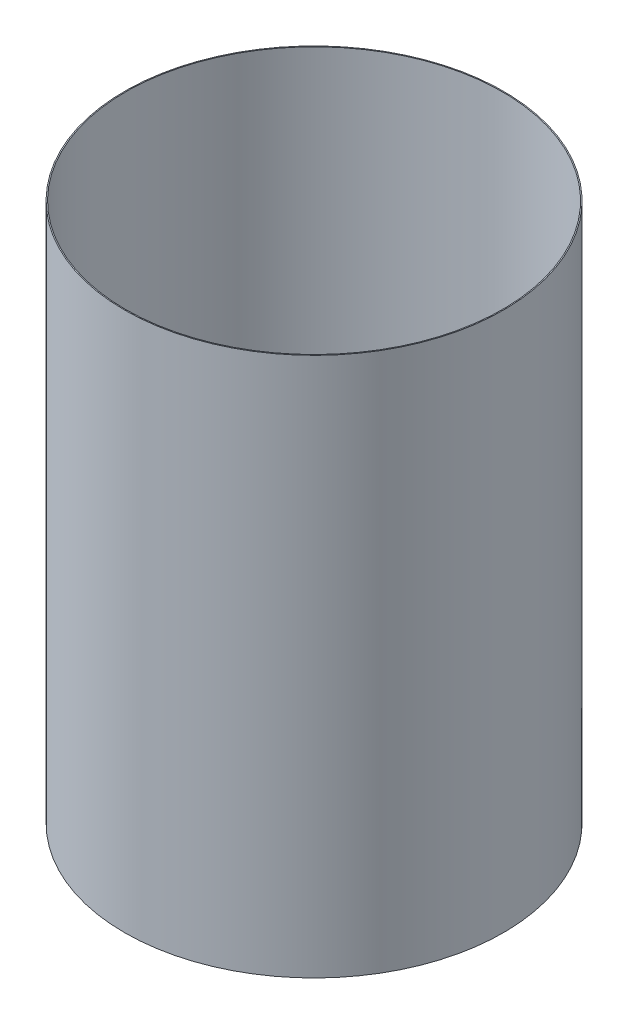
ISO-10303-21;
HEADER;
FILE_DESCRIPTION(('STEP AP214'),'2;1');
FILE_NAME('part.step','',(''),(''),'','','');
FILE_SCHEMA(('AUTOMOTIVE_DESIGN { 1 0 10303 214 1 1 1 1 }'));
ENDSEC;
DATA;
#1=APPLICATION_CONTEXT('core data for automotive mechanical design processes');
#2=APPLICATION_PROTOCOL_DEFINITION('international standard','automotive_design',2000,#1);
#3=PRODUCT_CONTEXT('',#1,'mechanical');
#4=PRODUCT('Part','Part','',(#3));
#5=PRODUCT_RELATED_PRODUCT_CATEGORY('part','',(#4));
#6=PRODUCT_DEFINITION_FORMATION('','',#4);
#7=PRODUCT_DEFINITION_CONTEXT('part definition',#1,'design');
#8=PRODUCT_DEFINITION('design','',#6,#7);
#9=PRODUCT_DEFINITION_SHAPE('','',#8);
#10=(LENGTH_UNIT() NAMED_UNIT(*) SI_UNIT(.MILLI.,.METRE.));
#11=(NAMED_UNIT(*) PLANE_ANGLE_UNIT() SI_UNIT($,.RADIAN.));
#12=(NAMED_UNIT(*) SI_UNIT($,.STERADIAN.) SOLID_ANGLE_UNIT());
#13=UNCERTAINTY_MEASURE_WITH_UNIT(LENGTH_MEASURE(1.E-05),#10,'distance_accuracy_value','');
#14=(GEOMETRIC_REPRESENTATION_CONTEXT(3) GLOBAL_UNCERTAINTY_ASSIGNED_CONTEXT((#13)) GLOBAL_UNIT_ASSIGNED_CONTEXT((#10,
#11,#12)) REPRESENTATION_CONTEXT('',''));
#15=CARTESIAN_POINT('',(0.,0.,0.));
#16=DIRECTION('',(0.,0.,1.));
#17=DIRECTION('',(1.,0.,0.));
#18=AXIS2_PLACEMENT_3D('',#15,#16,#17);
#19=CARTESIAN_POINT('',(0.,55.,0.));
#20=DIRECTION('',(0.,1.,0.));
#21=DIRECTION('',(0.,0.,1.));
#22=AXIS2_PLACEMENT_3D('',#19,#20,#21);
#23=CYLINDRICAL_SURFACE('',#22,46.863);
#24=CARTESIAN_POINT('',(0.,-153.255914232196,0.));
#25=DIRECTION('',(0.,1.,0.));
#26=DIRECTION('',(0.,0.,1.));
#27=AXIS2_PLACEMENT_3D('',#24,#25,#26);
#28=CIRCLE('',#27,46.863);
#29=CARTESIAN_POINT('',(0.,-153.255914232196,46.863));
#30=VERTEX_POINT('',#29);
#31=EDGE_CURVE('E45',#30,#30,#28,.T.);
#32=ORIENTED_EDGE('',*,*,#31,.T.);
#33=EDGE_LOOP('',(#32));
#34=FACE_BOUND('',#33,.T.);
#35=CARTESIAN_POINT('',(0.,-19.9059142321961,0.));
#36=DIRECTION('',(0.,1.,0.));
#37=DIRECTION('',(0.,0.,1.));
#38=AXIS2_PLACEMENT_3D('',#35,#36,#37);
#39=CIRCLE('',#38,46.863);
#40=CARTESIAN_POINT('',(0.,-19.9059142321961,46.863));
#41=VERTEX_POINT('',#40);
#42=EDGE_CURVE('E10',#41,#41,#39,.T.);
#43=ORIENTED_EDGE('',*,*,#42,.F.);
#44=EDGE_LOOP('',(#43));
#45=FACE_BOUND('',#44,.T.);
#46=ADVANCED_FACE('F31',(#34,#45),#23,.T.);
#47=CARTESIAN_POINT('',(-46.863,-19.905914232196,0.));
#48=DIRECTION('',(0.,-1.,0.));
#49=DIRECTION('',(0.,0.,-1.));
#50=AXIS2_PLACEMENT_3D('',#47,#48,#49);
#51=PLANE('',#50);
#52=CARTESIAN_POINT('',(0.,-19.9059142321961,0.));
#53=DIRECTION('',(0.,1.,0.));
#54=DIRECTION('',(0.,0.,1.));
#55=AXIS2_PLACEMENT_3D('',#52,#53,#54);
#56=CIRCLE('',#55,46.609);
#57=CARTESIAN_POINT('',(0.,-19.9059142321961,46.609));
#58=VERTEX_POINT('',#57);
#59=EDGE_CURVE('E37',#58,#58,#56,.T.);
#60=ORIENTED_EDGE('',*,*,#59,.F.);
#61=EDGE_LOOP('',(#60));
#62=FACE_BOUND('',#61,.T.);
#63=ORIENTED_EDGE('',*,*,#42,.T.);
#64=EDGE_LOOP('',(#63));
#65=FACE_BOUND('',#64,.T.);
#66=ADVANCED_FACE('F61',(#62,#65),#51,.F.);
#67=CARTESIAN_POINT('',(0.,55.,0.));
#68=DIRECTION('',(0.,1.,0.));
#69=DIRECTION('',(0.,0.,1.));
#70=AXIS2_PLACEMENT_3D('',#67,#68,#69);
#71=CYLINDRICAL_SURFACE('',#70,46.609);
#72=CARTESIAN_POINT('',(0.,-153.255914232196,0.));
#73=DIRECTION('',(0.,1.,0.));
#74=DIRECTION('',(0.,0.,1.));
#75=AXIS2_PLACEMENT_3D('',#72,#73,#74);
#76=CIRCLE('',#75,46.609);
#77=CARTESIAN_POINT('',(0.,-153.255914232196,46.609));
#78=VERTEX_POINT('',#77);
#79=EDGE_CURVE('E41',#78,#78,#76,.T.);
#80=ORIENTED_EDGE('',*,*,#79,.F.);
#81=EDGE_LOOP('',(#80));
#82=FACE_BOUND('',#81,.T.);
#83=ORIENTED_EDGE('',*,*,#59,.T.);
#84=EDGE_LOOP('',(#83));
#85=FACE_BOUND('',#84,.T.);
#86=ADVANCED_FACE('F56',(#82,#85),#71,.F.);
#87=CARTESIAN_POINT('',(-46.609,-153.255914232196,0.));
#88=DIRECTION('',(0.,1.,0.));
#89=DIRECTION('',(0.,0.,1.));
#90=AXIS2_PLACEMENT_3D('',#87,#88,#89);
#91=PLANE('',#90);
#92=ORIENTED_EDGE('',*,*,#31,.F.);
#93=EDGE_LOOP('',(#92));
#94=FACE_BOUND('',#93,.T.);
#95=ORIENTED_EDGE('',*,*,#79,.T.);
#96=EDGE_LOOP('',(#95));
#97=FACE_BOUND('',#96,.T.);
#98=ADVANCED_FACE('F53',(#94,#97),#91,.F.);
#99=CLOSED_SHELL('',(#46,#66,#86,#98));
#100=MANIFOLD_SOLID_BREP('B2',#99);
#101=ADVANCED_BREP_SHAPE_REPRESENTATION('',(#18,#100),#14);
#102=SHAPE_DEFINITION_REPRESENTATION(#9,#101);
ENDSEC;
END-ISO-10303-21;
